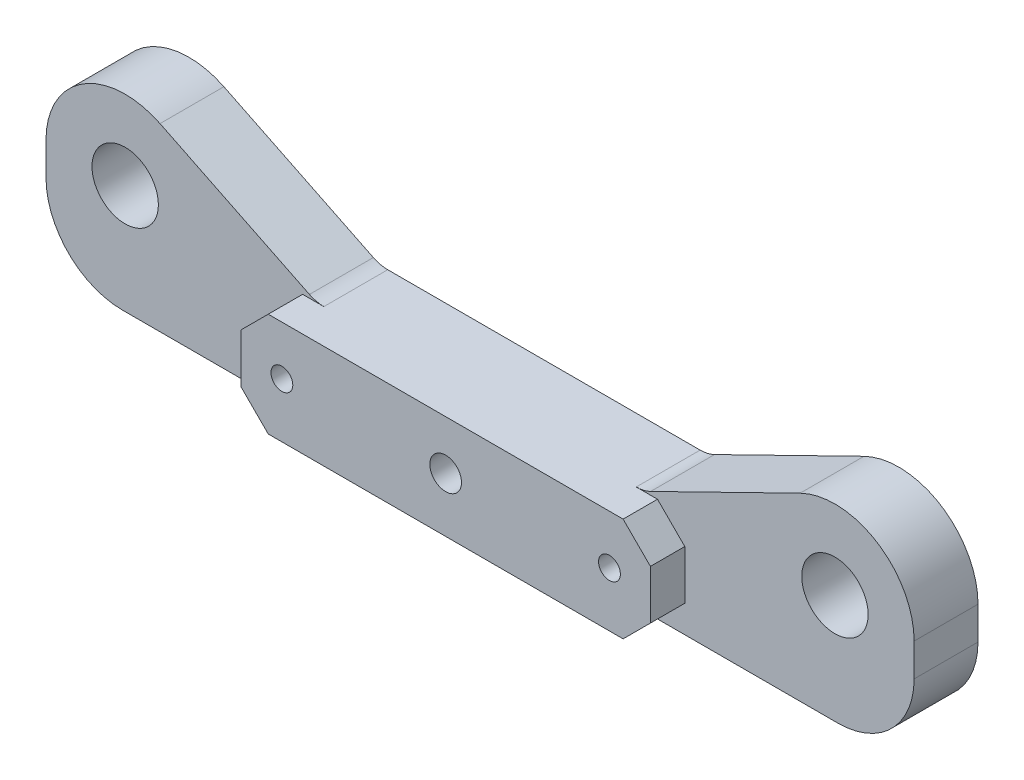
ISO-10303-21;
HEADER;
FILE_DESCRIPTION(('STEP AP214'),'2;1');
FILE_NAME('part.step','',(''),(''),'','','');
FILE_SCHEMA(('AUTOMOTIVE_DESIGN { 1 0 10303 214 1 1 1 1 }'));
ENDSEC;
DATA;
#1=APPLICATION_CONTEXT('core data for automotive mechanical design processes');
#2=APPLICATION_PROTOCOL_DEFINITION('international standard','automotive_design',2000,#1);
#3=PRODUCT_CONTEXT('',#1,'mechanical');
#4=PRODUCT('Part','Part','',(#3));
#5=PRODUCT_RELATED_PRODUCT_CATEGORY('part','',(#4));
#6=PRODUCT_DEFINITION_FORMATION('','',#4);
#7=PRODUCT_DEFINITION_CONTEXT('part definition',#1,'design');
#8=PRODUCT_DEFINITION('design','',#6,#7);
#9=PRODUCT_DEFINITION_SHAPE('','',#8);
#10=(LENGTH_UNIT() NAMED_UNIT(*) SI_UNIT(.MILLI.,.METRE.));
#11=(NAMED_UNIT(*) PLANE_ANGLE_UNIT() SI_UNIT($,.RADIAN.));
#12=(NAMED_UNIT(*) SI_UNIT($,.STERADIAN.) SOLID_ANGLE_UNIT());
#13=UNCERTAINTY_MEASURE_WITH_UNIT(LENGTH_MEASURE(1.E-05),#10,'distance_accuracy_value','');
#14=(GEOMETRIC_REPRESENTATION_CONTEXT(3) GLOBAL_UNCERTAINTY_ASSIGNED_CONTEXT((#13)) GLOBAL_UNIT_ASSIGNED_CONTEXT((#10,
#11,#12)) REPRESENTATION_CONTEXT('',''));
#15=CARTESIAN_POINT('',(0.,0.,0.));
#16=DIRECTION('',(0.,0.,1.));
#17=DIRECTION('',(1.,0.,0.));
#18=AXIS2_PLACEMENT_3D('',#15,#16,#17);
#19=CARTESIAN_POINT('',(-15.,0.,-9.));
#20=DIRECTION('',(0.,0.,-1.));
#21=DIRECTION('',(1.,0.,0.));
#22=AXIS2_PLACEMENT_3D('',#19,#20,#21);
#23=CYLINDRICAL_SURFACE('',#22,0.999999999999994);
#24=CARTESIAN_POINT('',(-15.,0.,0.));
#25=DIRECTION('',(0.,0.,-1.));
#26=DIRECTION('',(-1.,0.,0.));
#27=AXIS2_PLACEMENT_3D('',#24,#25,#26);
#28=CIRCLE('',#27,0.999999999999994);
#29=CARTESIAN_POINT('',(-16.,0.,0.));
#30=VERTEX_POINT('',#29);
#31=EDGE_CURVE('E335',#30,#30,#28,.T.);
#32=ORIENTED_EDGE('',*,*,#31,.F.);
#33=EDGE_LOOP('',(#32));
#34=FACE_BOUND('',#33,.T.);
#35=CARTESIAN_POINT('',(-15.,0.,-7.));
#36=DIRECTION('',(0.,0.,1.));
#37=DIRECTION('',(1.,0.,0.));
#38=AXIS2_PLACEMENT_3D('',#35,#36,#37);
#39=CIRCLE('',#38,0.999999999999994);
#40=CARTESIAN_POINT('',(-14.,0.,-7.));
#41=VERTEX_POINT('',#40);
#42=EDGE_CURVE('E269',#41,#41,#39,.F.);
#43=ORIENTED_EDGE('',*,*,#42,.T.);
#44=EDGE_LOOP('',(#43));
#45=FACE_BOUND('',#44,.T.);
#46=ADVANCED_FACE('F40',(#34,#45),#23,.F.);
#47=CARTESIAN_POINT('',(-32.5,5.,17.3560966544099));
#48=DIRECTION('',(0.,0.,-1.));
#49=DIRECTION('',(1.,0.,0.));
#50=AXIS2_PLACEMENT_3D('',#47,#48,#49);
#51=CYLINDRICAL_SURFACE('',#50,7.25000000000001);
#52=DIRECTION('',(0.,0.,1.));
#53=VECTOR('',#52,1.);
#54=CARTESIAN_POINT('',(-39.75,4.99999999999995,-19.0498756211209));
#55=LINE('',#54,#53);
#56=CARTESIAN_POINT('',(-39.75,4.99999999999995,-9.));
#57=VERTEX_POINT('',#56);
#58=CARTESIAN_POINT('',(-39.75,4.99999999999995,-3.15000000000003));
#59=VERTEX_POINT('',#58);
#60=EDGE_CURVE('E180',#57,#59,#55,.T.);
#61=ORIENTED_EDGE('',*,*,#60,.T.);
#62=CARTESIAN_POINT('',(-32.5,5.,-3.15));
#63=DIRECTION('',(0.,0.,1.));
#64=DIRECTION('',(1.,0.,0.));
#65=AXIS2_PLACEMENT_3D('',#62,#63,#64);
#66=CIRCLE('',#65,7.25000000000001);
#67=CARTESIAN_POINT('',(-29.3104090214584,11.5106842489562,-3.15));
#68=VERTEX_POINT('',#67);
#69=EDGE_CURVE('E188',#59,#68,#66,.F.);
#70=ORIENTED_EDGE('',*,*,#69,.T.);
#71=DIRECTION('',(0.,0.,1.));
#72=VECTOR('',#71,1.);
#73=CARTESIAN_POINT('',(-29.3104090214584,11.5106842489562,-24.9354165304833));
#74=LINE('',#73,#72);
#75=CARTESIAN_POINT('',(-29.3104090214584,11.5106842489562,-9.));
#76=VERTEX_POINT('',#75);
#77=EDGE_CURVE('E248',#76,#68,#74,.T.);
#78=ORIENTED_EDGE('',*,*,#77,.F.);
#79=CARTESIAN_POINT('',(-32.5,5.,-9.));
#80=DIRECTION('',(0.,0.,1.));
#81=DIRECTION('',(1.,0.,0.));
#82=AXIS2_PLACEMENT_3D('',#79,#80,#81);
#83=CIRCLE('',#82,7.25000000000001);
#84=EDGE_CURVE('E199',#76,#57,#83,.T.);
#85=ORIENTED_EDGE('',*,*,#84,.T.);
#86=EDGE_LOOP('',(#61,#70,#78,#85));
#87=FACE_BOUND('',#86,.T.);
#88=ADVANCED_FACE('F202',(#87),#51,.T.);
#89=CARTESIAN_POINT('',(38.75,-3.50000000000001,-3.14999999999999));
#90=DIRECTION('',(0.,0.,-1.));
#91=DIRECTION('',(1.,0.,0.));
#92=AXIS2_PLACEMENT_3D('',#89,#90,#91);
#93=PLANE('',#92);
#94=DIRECTION('',(0.,-1.,0.));
#95=VECTOR('',#94,1.);
#96=CARTESIAN_POINT('',(39.75,4.99999999999995,-3.14999999999999));
#97=LINE('',#96,#95);
#98=CARTESIAN_POINT('',(39.75,4.99999999999999,-3.15));
#99=VERTEX_POINT('',#98);
#100=CARTESIAN_POINT('',(39.75,2.,-3.14999999999999));
#101=VERTEX_POINT('',#100);
#102=EDGE_CURVE('E204',#99,#101,#97,.T.);
#103=ORIENTED_EDGE('',*,*,#102,.F.);
#104=CARTESIAN_POINT('',(32.5,5.,-3.15));
#105=DIRECTION('',(0.,0.,1.));
#106=DIRECTION('',(1.,0.,0.));
#107=AXIS2_PLACEMENT_3D('',#104,#105,#106);
#108=CIRCLE('',#107,7.25000000000001);
#109=CARTESIAN_POINT('',(29.3104090214584,11.5106842489562,-3.15000000000002));
#110=VERTEX_POINT('',#109);
#111=EDGE_CURVE('E291',#110,#99,#108,.F.);
#112=ORIENTED_EDGE('',*,*,#111,.F.);
#113=DIRECTION('',(0.898025413649127,0.439943583247118,0.));
#114=VECTOR('',#113,1.);
#115=CARTESIAN_POINT('',(29.3104090214584,11.5106842489562,-3.15000000000002));
#116=LINE('',#115,#114);
#117=CARTESIAN_POINT('',(15.624460318845,4.80592375905262,-3.15000000000001));
#118=VERTEX_POINT('',#117);
#119=EDGE_CURVE('E283',#118,#110,#116,.T.);
#120=ORIENTED_EDGE('',*,*,#119,.F.);
#121=CARTESIAN_POINT('',(14.3046295691037,7.5,-3.15));
#122=DIRECTION('',(0.,0.,1.));
#123=DIRECTION('',(1.,0.,0.));
#124=AXIS2_PLACEMENT_3D('',#121,#122,#123);
#125=CIRCLE('',#124,3.);
#126=CARTESIAN_POINT('',(14.3046295691037,4.5,-3.15000000000001));
#127=VERTEX_POINT('',#126);
#128=EDGE_CURVE('E397',#127,#118,#125,.T.);
#129=ORIENTED_EDGE('',*,*,#128,.F.);
#130=DIRECTION('',(-1.,0.,0.));
#131=VECTOR('',#130,1.);
#132=CARTESIAN_POINT('',(15.,4.5,-3.15000000000001));
#133=LINE('',#132,#131);
#134=CARTESIAN_POINT('',(16.25,4.5,-3.15000000000001));
#135=VERTEX_POINT('',#134);
#136=EDGE_CURVE('E278',#135,#127,#133,.T.);
#137=ORIENTED_EDGE('',*,*,#136,.F.);
#138=DIRECTION('',(-0.707106781186546,0.707106781186549,0.));
#139=VECTOR('',#138,1.);
#140=CARTESIAN_POINT('',(31.5,-10.75,-3.14999999999999));
#141=LINE('',#140,#139);
#142=CARTESIAN_POINT('',(18.75,2.,-3.15));
#143=VERTEX_POINT('',#142);
#144=EDGE_CURVE('E263',#143,#135,#141,.T.);
#145=ORIENTED_EDGE('',*,*,#144,.F.);
#146=DIRECTION('',(0.,1.,0.));
#147=VECTOR('',#146,1.);
#148=CARTESIAN_POINT('',(18.75,-3.50000000000001,-3.15));
#149=LINE('',#148,#147);
#150=CARTESIAN_POINT('',(18.75,-2.49999999999998,-3.15));
#151=VERTEX_POINT('',#150);
#152=EDGE_CURVE('E338',#151,#143,#149,.T.);
#153=ORIENTED_EDGE('',*,*,#152,.F.);
#154=DIRECTION('',(0.707106781186546,0.707106781186549,0.));
#155=VECTOR('',#154,1.);
#156=CARTESIAN_POINT('',(28.2499999999999,7.,-3.14999999999999));
#157=LINE('',#156,#155);
#158=CARTESIAN_POINT('',(16.25,-5.,-3.15));
#159=VERTEX_POINT('',#158);
#160=EDGE_CURVE('E264',#159,#151,#157,.T.);
#161=ORIENTED_EDGE('',*,*,#160,.F.);
#162=DIRECTION('',(1.,0.,0.));
#163=VECTOR('',#162,1.);
#164=CARTESIAN_POINT('',(18.75,-5.,-3.15));
#165=LINE('',#164,#163);
#166=CARTESIAN_POINT('',(32.75,-5.,-3.14999999999999));
#167=VERTEX_POINT('',#166);
#168=EDGE_CURVE('E218',#159,#167,#165,.T.);
#169=ORIENTED_EDGE('',*,*,#168,.T.);
#170=CARTESIAN_POINT('',(32.75,2.,-3.14999999999999));
#171=DIRECTION('',(0.,0.,1.));
#172=DIRECTION('',(1.,0.,0.));
#173=AXIS2_PLACEMENT_3D('',#170,#171,#172);
#174=CIRCLE('',#173,7.);
#175=EDGE_CURVE('E12',#101,#167,#174,.F.);
#176=ORIENTED_EDGE('',*,*,#175,.F.);
#177=EDGE_LOOP('',(#103,#112,#120,#129,#137,#145,#153,#161,#169,#176));
#178=FACE_BOUND('',#177,.T.);
#179=CARTESIAN_POINT('',(32.5,5.,-3.14999999999999));
#180=DIRECTION('',(0.,0.,1.));
#181=DIRECTION('',(1.,0.,0.));
#182=AXIS2_PLACEMENT_3D('',#179,#180,#181);
#183=CIRCLE('',#182,3.04);
#184=CARTESIAN_POINT('',(35.54,5.,-3.14999999999999));
#185=VERTEX_POINT('',#184);
#186=EDGE_CURVE('E334',#185,#185,#183,.F.);
#187=ORIENTED_EDGE('',*,*,#186,.T.);
#188=EDGE_LOOP('',(#187));
#189=FACE_BOUND('',#188,.T.);
#190=ADVANCED_FACE('F447',(#178,#189),#93,.F.);
#191=CARTESIAN_POINT('',(-38.75,3.49999999999999,-9.));
#192=DIRECTION('',(0.,0.,-1.));
#193=DIRECTION('',(1.,0.,0.));
#194=AXIS2_PLACEMENT_3D('',#191,#192,#193);
#195=PLANE('',#194);
#196=DIRECTION('',(0.,1.,0.));
#197=VECTOR('',#196,1.);
#198=CARTESIAN_POINT('',(-39.75,4.99999999999995,-9.));
#199=LINE('',#198,#197);
#200=CARTESIAN_POINT('',(-39.75,2.,-9.));
#201=VERTEX_POINT('',#200);
#202=EDGE_CURVE('E185',#201,#57,#199,.T.);
#203=ORIENTED_EDGE('',*,*,#202,.T.);
#204=ORIENTED_EDGE('',*,*,#84,.F.);
#205=DIRECTION('',(0.898025413649127,-0.439943583247118,0.));
#206=VECTOR('',#205,1.);
#207=CARTESIAN_POINT('',(-29.3104090214584,11.5106842489562,-9.));
#208=LINE('',#207,#206);
#209=CARTESIAN_POINT('',(-15.624460318845,4.80592375905261,-9.));
#210=VERTEX_POINT('',#209);
#211=EDGE_CURVE('E254',#76,#210,#208,.T.);
#212=ORIENTED_EDGE('',*,*,#211,.T.);
#213=CARTESIAN_POINT('',(-14.3046295691037,7.5,-9.));
#214=DIRECTION('',(0.,0.,1.));
#215=DIRECTION('',(1.,0.,0.));
#216=AXIS2_PLACEMENT_3D('',#213,#214,#215);
#217=CIRCLE('',#216,3.);
#218=CARTESIAN_POINT('',(-14.3046295691037,4.5,-9.));
#219=VERTEX_POINT('',#218);
#220=EDGE_CURVE('E383',#219,#210,#217,.F.);
#221=ORIENTED_EDGE('',*,*,#220,.F.);
#222=DIRECTION('',(1.,0.,0.));
#223=VECTOR('',#222,1.);
#224=CARTESIAN_POINT('',(-26.25,4.5,-9.));
#225=LINE('',#224,#223);
#226=CARTESIAN_POINT('',(14.3046295691037,4.5,-9.));
#227=VERTEX_POINT('',#226);
#228=EDGE_CURVE('E300',#219,#227,#225,.T.);
#229=ORIENTED_EDGE('',*,*,#228,.T.);
#230=CARTESIAN_POINT('',(14.3046295691037,7.5,-9.));
#231=DIRECTION('',(0.,0.,1.));
#232=DIRECTION('',(1.,0.,0.));
#233=AXIS2_PLACEMENT_3D('',#230,#231,#232);
#234=CIRCLE('',#233,3.);
#235=CARTESIAN_POINT('',(15.624460318845,4.80592375905262,-9.));
#236=VERTEX_POINT('',#235);
#237=EDGE_CURVE('E380',#236,#227,#234,.F.);
#238=ORIENTED_EDGE('',*,*,#237,.F.);
#239=DIRECTION('',(0.898025413649127,0.439943583247118,0.));
#240=VECTOR('',#239,1.);
#241=CARTESIAN_POINT('',(29.3104090214584,11.5106842489562,-9.));
#242=LINE('',#241,#240);
#243=CARTESIAN_POINT('',(29.3104090214584,11.5106842489562,-9.));
#244=VERTEX_POINT('',#243);
#245=EDGE_CURVE('E285',#236,#244,#242,.T.);
#246=ORIENTED_EDGE('',*,*,#245,.T.);
#247=CARTESIAN_POINT('',(32.5,5.,-9.));
#248=DIRECTION('',(0.,0.,1.));
#249=DIRECTION('',(-1.,0.,0.));
#250=AXIS2_PLACEMENT_3D('',#247,#248,#249);
#251=CIRCLE('',#250,7.25000000000001);
#252=CARTESIAN_POINT('',(39.75,4.99999999999995,-9.));
#253=VERTEX_POINT('',#252);
#254=EDGE_CURVE('E290',#253,#244,#251,.T.);
#255=ORIENTED_EDGE('',*,*,#254,.F.);
#256=DIRECTION('',(0.,-1.,0.));
#257=VECTOR('',#256,1.);
#258=CARTESIAN_POINT('',(39.75,4.99999999999995,-9.));
#259=LINE('',#258,#257);
#260=CARTESIAN_POINT('',(39.75,2.,-9.));
#261=VERTEX_POINT('',#260);
#262=EDGE_CURVE('E206',#253,#261,#259,.T.);
#263=ORIENTED_EDGE('',*,*,#262,.T.);
#264=CARTESIAN_POINT('',(32.75,2.,-9.));
#265=DIRECTION('',(0.,0.,1.));
#266=DIRECTION('',(1.,0.,0.));
#267=AXIS2_PLACEMENT_3D('',#264,#265,#266);
#268=CIRCLE('',#267,7.);
#269=CARTESIAN_POINT('',(32.75,-5.,-9.));
#270=VERTEX_POINT('',#269);
#271=EDGE_CURVE('E467',#270,#261,#268,.T.);
#272=ORIENTED_EDGE('',*,*,#271,.F.);
#273=DIRECTION('',(-1.,0.,0.));
#274=VECTOR('',#273,1.);
#275=CARTESIAN_POINT('',(38.75,-5.,-9.));
#276=LINE('',#275,#274);
#277=CARTESIAN_POINT('',(-32.75,-5.,-9.));
#278=VERTEX_POINT('',#277);
#279=EDGE_CURVE('E223',#270,#278,#276,.T.);
#280=ORIENTED_EDGE('',*,*,#279,.T.);
#281=CARTESIAN_POINT('',(-32.75,2.,-9.));
#282=DIRECTION('',(0.,0.,1.));
#283=DIRECTION('',(1.,0.,0.));
#284=AXIS2_PLACEMENT_3D('',#281,#282,#283);
#285=CIRCLE('',#284,7.);
#286=EDGE_CURVE('E465',#201,#278,#285,.T.);
#287=ORIENTED_EDGE('',*,*,#286,.F.);
#288=EDGE_LOOP('',(#203,#204,#212,#221,#229,#238,#246,#255,#263,#272,#280,#287));
#289=FACE_BOUND('',#288,.T.);
#290=CARTESIAN_POINT('',(0.,0.,-9.));
#291=DIRECTION('',(0.,0.,1.));
#292=DIRECTION('',(1.,0.,0.));
#293=AXIS2_PLACEMENT_3D('',#290,#291,#292);
#294=CIRCLE('',#293,2.75);
#295=CARTESIAN_POINT('',(2.75,0.,-9.));
#296=VERTEX_POINT('',#295);
#297=EDGE_CURVE('E369',#296,#296,#294,.T.);
#298=ORIENTED_EDGE('',*,*,#297,.T.);
#299=EDGE_LOOP('',(#298));
#300=FACE_BOUND('',#299,.T.);
#301=CARTESIAN_POINT('',(-32.5,5.,-9.));
#302=DIRECTION('',(0.,0.,1.));
#303=DIRECTION('',(1.,0.,0.));
#304=AXIS2_PLACEMENT_3D('',#301,#302,#303);
#305=CIRCLE('',#304,3.04);
#306=CARTESIAN_POINT('',(-29.46,5.,-9.));
#307=VERTEX_POINT('',#306);
#308=EDGE_CURVE('E232',#307,#307,#305,.T.);
#309=ORIENTED_EDGE('',*,*,#308,.T.);
#310=EDGE_LOOP('',(#309));
#311=FACE_BOUND('',#310,.T.);
#312=CARTESIAN_POINT('',(32.5,5.,-9.));
#313=DIRECTION('',(0.,0.,1.));
#314=DIRECTION('',(1.,0.,0.));
#315=AXIS2_PLACEMENT_3D('',#312,#313,#314);
#316=CIRCLE('',#315,3.04);
#317=CARTESIAN_POINT('',(35.54,5.,-9.));
#318=VERTEX_POINT('',#317);
#319=EDGE_CURVE('E561',#318,#318,#316,.F.);
#320=ORIENTED_EDGE('',*,*,#319,.F.);
#321=EDGE_LOOP('',(#320));
#322=FACE_BOUND('',#321,.T.);
#323=ADVANCED_FACE('F378',(#289,#300,#311,#322),#195,.T.);
#324=CARTESIAN_POINT('',(-32.5,5.,-22.));
#325=DIRECTION('',(0.,0.,1.));
#326=DIRECTION('',(-1.,0.,0.));
#327=AXIS2_PLACEMENT_3D('',#324,#325,#326);
#328=CYLINDRICAL_SURFACE('',#327,3.04);
#329=CARTESIAN_POINT('',(-32.5,5.,-3.15));
#330=DIRECTION('',(0.,0.,1.));
#331=DIRECTION('',(1.,0.,0.));
#332=AXIS2_PLACEMENT_3D('',#329,#330,#331);
#333=CIRCLE('',#332,3.04);
#334=CARTESIAN_POINT('',(-29.46,5.,-3.15));
#335=VERTEX_POINT('',#334);
#336=EDGE_CURVE('E342',#335,#335,#333,.F.);
#337=ORIENTED_EDGE('',*,*,#336,.F.);
#338=EDGE_LOOP('',(#337));
#339=FACE_BOUND('',#338,.T.);
#340=ORIENTED_EDGE('',*,*,#308,.F.);
#341=EDGE_LOOP('',(#340));
#342=FACE_BOUND('',#341,.T.);
#343=ADVANCED_FACE('F509',(#339,#342),#328,.F.);
#344=CARTESIAN_POINT('',(32.5,5.,-22.));
#345=DIRECTION('',(0.,0.,1.));
#346=DIRECTION('',(-1.,0.,0.));
#347=AXIS2_PLACEMENT_3D('',#344,#345,#346);
#348=CYLINDRICAL_SURFACE('',#347,3.04);
#349=ORIENTED_EDGE('',*,*,#186,.F.);
#350=EDGE_LOOP('',(#349));
#351=FACE_BOUND('',#350,.T.);
#352=ORIENTED_EDGE('',*,*,#319,.T.);
#353=EDGE_LOOP('',(#352));
#354=FACE_BOUND('',#353,.T.);
#355=ADVANCED_FACE('F506',(#351,#354),#348,.F.);
#356=CARTESIAN_POINT('',(-38.75,-3.50000000000001,-3.15));
#357=DIRECTION('',(0.,0.,-1.));
#358=DIRECTION('',(1.,0.,0.));
#359=AXIS2_PLACEMENT_3D('',#356,#357,#358);
#360=PLANE('',#359);
#361=DIRECTION('',(1.,0.,0.));
#362=VECTOR('',#361,1.);
#363=CARTESIAN_POINT('',(-38.75,-5.00000000000001,-3.15));
#364=LINE('',#363,#362);
#365=CARTESIAN_POINT('',(-32.75,-5.,-3.15));
#366=VERTEX_POINT('',#365);
#367=CARTESIAN_POINT('',(-16.25,-5.,-3.15));
#368=VERTEX_POINT('',#367);
#369=EDGE_CURVE('E229',#366,#368,#364,.T.);
#370=ORIENTED_EDGE('',*,*,#369,.T.);
#371=DIRECTION('',(0.707106781186546,-0.707106781186549,0.));
#372=VECTOR('',#371,1.);
#373=CARTESIAN_POINT('',(-28.25,6.99999999999998,-3.15));
#374=LINE('',#373,#372);
#375=CARTESIAN_POINT('',(-18.75,-2.5,-3.15));
#376=VERTEX_POINT('',#375);
#377=EDGE_CURVE('E414',#376,#368,#374,.T.);
#378=ORIENTED_EDGE('',*,*,#377,.F.);
#379=DIRECTION('',(0.,1.,0.));
#380=VECTOR('',#379,1.);
#381=CARTESIAN_POINT('',(-18.75,-3.50000000000001,-3.15));
#382=LINE('',#381,#380);
#383=CARTESIAN_POINT('',(-18.75,1.99999999999998,-3.15));
#384=VERTEX_POINT('',#383);
#385=EDGE_CURVE('E341',#376,#384,#382,.T.);
#386=ORIENTED_EDGE('',*,*,#385,.T.);
#387=DIRECTION('',(-0.707106781186546,-0.707106781186549,0.));
#388=VECTOR('',#387,1.);
#389=CARTESIAN_POINT('',(-31.5,-10.75,-3.15));
#390=LINE('',#389,#388);
#391=CARTESIAN_POINT('',(-16.25,4.5,-3.15));
#392=VERTEX_POINT('',#391);
#393=EDGE_CURVE('E259',#392,#384,#390,.T.);
#394=ORIENTED_EDGE('',*,*,#393,.F.);
#395=DIRECTION('',(-1.,0.,0.));
#396=VECTOR('',#395,1.);
#397=CARTESIAN_POINT('',(-15.,4.5,-3.15));
#398=LINE('',#397,#396);
#399=CARTESIAN_POINT('',(-14.3046295691037,4.5,-3.15));
#400=VERTEX_POINT('',#399);
#401=EDGE_CURVE('E249',#400,#392,#398,.T.);
#402=ORIENTED_EDGE('',*,*,#401,.F.);
#403=CARTESIAN_POINT('',(-14.3046295691037,7.5,-3.15));
#404=DIRECTION('',(0.,0.,1.));
#405=DIRECTION('',(1.,0.,0.));
#406=AXIS2_PLACEMENT_3D('',#403,#404,#405);
#407=CIRCLE('',#406,3.);
#408=CARTESIAN_POINT('',(-15.624460318845,4.80592375905262,-3.15));
#409=VERTEX_POINT('',#408);
#410=EDGE_CURVE('E396',#409,#400,#407,.T.);
#411=ORIENTED_EDGE('',*,*,#410,.F.);
#412=DIRECTION('',(0.898025413649127,-0.439943583247118,0.));
#413=VECTOR('',#412,1.);
#414=CARTESIAN_POINT('',(-29.3104090214584,11.5106842489562,-3.14999999999999));
#415=LINE('',#414,#413);
#416=EDGE_CURVE('E194',#68,#409,#415,.T.);
#417=ORIENTED_EDGE('',*,*,#416,.F.);
#418=ORIENTED_EDGE('',*,*,#69,.F.);
#419=DIRECTION('',(0.,1.,0.));
#420=VECTOR('',#419,1.);
#421=CARTESIAN_POINT('',(-39.75,4.99999999999995,-3.15000000000003));
#422=LINE('',#421,#420);
#423=CARTESIAN_POINT('',(-39.75,2.,-3.15000000000003));
#424=VERTEX_POINT('',#423);
#425=EDGE_CURVE('E175',#424,#59,#422,.T.);
#426=ORIENTED_EDGE('',*,*,#425,.F.);
#427=CARTESIAN_POINT('',(-32.75,2.,-3.15));
#428=DIRECTION('',(0.,0.,1.));
#429=DIRECTION('',(1.,0.,0.));
#430=AXIS2_PLACEMENT_3D('',#427,#428,#429);
#431=CIRCLE('',#430,7.);
#432=EDGE_CURVE('E457',#366,#424,#431,.F.);
#433=ORIENTED_EDGE('',*,*,#432,.F.);
#434=EDGE_LOOP('',(#370,#378,#386,#394,#402,#411,#417,#418,#426,#433));
#435=FACE_BOUND('',#434,.T.);
#436=ORIENTED_EDGE('',*,*,#336,.T.);
#437=EDGE_LOOP('',(#436));
#438=FACE_BOUND('',#437,.T.);
#439=ADVANCED_FACE('F190',(#435,#438),#360,.F.);
#440=CARTESIAN_POINT('',(-18.75,-3.50000000000001,3.15));
#441=DIRECTION('',(1.,0.,0.));
#442=DIRECTION('',(0.,1.,0.));
#443=AXIS2_PLACEMENT_3D('',#440,#441,#442);
#444=PLANE('',#443);
#445=DIRECTION('',(0.,-1.,0.));
#446=VECTOR('',#445,1.);
#447=CARTESIAN_POINT('',(-18.75,-3.50000000000001,0.));
#448=LINE('',#447,#446);
#449=CARTESIAN_POINT('',(-18.75,1.99999999999998,0.));
#450=VERTEX_POINT('',#449);
#451=CARTESIAN_POINT('',(-18.75,-2.5,0.));
#452=VERTEX_POINT('',#451);
#453=EDGE_CURVE('E330',#450,#452,#448,.T.);
#454=ORIENTED_EDGE('',*,*,#453,.F.);
#455=DIRECTION('',(0.,0.,1.));
#456=VECTOR('',#455,1.);
#457=CARTESIAN_POINT('',(-18.75,1.99999999999998,0.));
#458=LINE('',#457,#456);
#459=EDGE_CURVE('E324',#384,#450,#458,.T.);
#460=ORIENTED_EDGE('',*,*,#459,.F.);
#461=ORIENTED_EDGE('',*,*,#385,.F.);
#462=DIRECTION('',(0.,0.,-1.));
#463=VECTOR('',#462,1.);
#464=CARTESIAN_POINT('',(-18.75,-2.5,-3.15));
#465=LINE('',#464,#463);
#466=EDGE_CURVE('E437',#452,#376,#465,.T.);
#467=ORIENTED_EDGE('',*,*,#466,.F.);
#468=EDGE_LOOP('',(#454,#460,#461,#467));
#469=FACE_BOUND('',#468,.T.);
#470=ADVANCED_FACE('F456',(#469),#444,.F.);
#471=CARTESIAN_POINT('',(18.75,-3.50000000000001,3.15));
#472=DIRECTION('',(-1.,0.,0.));
#473=DIRECTION('',(0.,-1.,0.));
#474=AXIS2_PLACEMENT_3D('',#471,#472,#473);
#475=PLANE('',#474);
#476=ORIENTED_EDGE('',*,*,#152,.T.);
#477=DIRECTION('',(0.,0.,-1.));
#478=VECTOR('',#477,1.);
#479=CARTESIAN_POINT('',(18.75,2.,-3.15));
#480=LINE('',#479,#478);
#481=CARTESIAN_POINT('',(18.75,2.,0.));
#482=VERTEX_POINT('',#481);
#483=EDGE_CURVE('E432',#482,#143,#480,.T.);
#484=ORIENTED_EDGE('',*,*,#483,.F.);
#485=DIRECTION('',(0.,-1.,0.));
#486=VECTOR('',#485,1.);
#487=CARTESIAN_POINT('',(18.75,-3.50000000000001,0.));
#488=LINE('',#487,#486);
#489=CARTESIAN_POINT('',(18.75,-2.49999999999998,0.));
#490=VERTEX_POINT('',#489);
#491=EDGE_CURVE('E346',#482,#490,#488,.T.);
#492=ORIENTED_EDGE('',*,*,#491,.T.);
#493=DIRECTION('',(0.,0.,1.));
#494=VECTOR('',#493,1.);
#495=CARTESIAN_POINT('',(18.75,-2.49999999999998,0.));
#496=LINE('',#495,#494);
#497=EDGE_CURVE('E427',#151,#490,#496,.T.);
#498=ORIENTED_EDGE('',*,*,#497,.F.);
#499=EDGE_LOOP('',(#476,#484,#492,#498));
#500=FACE_BOUND('',#499,.T.);
#501=ADVANCED_FACE('F433',(#500),#475,.F.);
#502=CARTESIAN_POINT('',(15.,11.5,0.));
#503=DIRECTION('',(0.,0.,1.));
#504=DIRECTION('',(-1.,0.,0.));
#505=AXIS2_PLACEMENT_3D('',#502,#503,#504);
#506=PLANE('',#505);
#507=CARTESIAN_POINT('',(0.,0.,0.));
#508=DIRECTION('',(0.,0.,1.));
#509=DIRECTION('',(1.,0.,0.));
#510=AXIS2_PLACEMENT_3D('',#507,#508,#509);
#511=CIRCLE('',#510,1.45);
#512=CARTESIAN_POINT('',(1.45,0.,0.));
#513=VERTEX_POINT('',#512);
#514=EDGE_CURVE('E360',#513,#513,#511,.T.);
#515=ORIENTED_EDGE('',*,*,#514,.F.);
#516=EDGE_LOOP('',(#515));
#517=FACE_BOUND('',#516,.T.);
#518=CARTESIAN_POINT('',(15.,0.,0.));
#519=DIRECTION('',(0.,0.,-1.));
#520=DIRECTION('',(-1.,0.,0.));
#521=AXIS2_PLACEMENT_3D('',#518,#519,#520);
#522=CIRCLE('',#521,0.999999999999997);
#523=CARTESIAN_POINT('',(14.,0.,0.));
#524=VERTEX_POINT('',#523);
#525=EDGE_CURVE('E336',#524,#524,#522,.T.);
#526=ORIENTED_EDGE('',*,*,#525,.T.);
#527=EDGE_LOOP('',(#526));
#528=FACE_BOUND('',#527,.T.);
#529=ORIENTED_EDGE('',*,*,#31,.T.);
#530=EDGE_LOOP('',(#529));
#531=FACE_BOUND('',#530,.T.);
#532=DIRECTION('',(1.,0.,0.));
#533=VECTOR('',#532,1.);
#534=CARTESIAN_POINT('',(-18.75,-5.,0.));
#535=LINE('',#534,#533);
#536=CARTESIAN_POINT('',(-16.25,-5.,0.));
#537=VERTEX_POINT('',#536);
#538=CARTESIAN_POINT('',(16.25,-5.,0.));
#539=VERTEX_POINT('',#538);
#540=EDGE_CURVE('E224',#537,#539,#535,.T.);
#541=ORIENTED_EDGE('',*,*,#540,.T.);
#542=DIRECTION('',(-0.707106781186546,-0.707106781186549,0.));
#543=VECTOR('',#542,1.);
#544=CARTESIAN_POINT('',(23.875,2.62500000000004,0.));
#545=LINE('',#544,#543);
#546=EDGE_CURVE('E317',#490,#539,#545,.T.);
#547=ORIENTED_EDGE('',*,*,#546,.F.);
#548=ORIENTED_EDGE('',*,*,#491,.F.);
#549=DIRECTION('',(0.707106781186546,-0.707106781186549,0.));
#550=VECTOR('',#549,1.);
#551=CARTESIAN_POINT('',(12.125,8.62500000000002,0.));
#552=LINE('',#551,#550);
#553=CARTESIAN_POINT('',(16.25,4.5,0.));
#554=VERTEX_POINT('',#553);
#555=EDGE_CURVE('E309',#554,#482,#552,.T.);
#556=ORIENTED_EDGE('',*,*,#555,.F.);
#557=DIRECTION('',(-1.,0.,0.));
#558=VECTOR('',#557,1.);
#559=CARTESIAN_POINT('',(18.75,4.5,0.));
#560=LINE('',#559,#558);
#561=CARTESIAN_POINT('',(-16.25,4.5,0.));
#562=VERTEX_POINT('',#561);
#563=EDGE_CURVE('E198',#554,#562,#560,.T.);
#564=ORIENTED_EDGE('',*,*,#563,.T.);
#565=DIRECTION('',(0.707106781186546,0.707106781186549,0.));
#566=VECTOR('',#565,1.);
#567=CARTESIAN_POINT('',(2.87499999999991,23.625,0.));
#568=LINE('',#567,#566);
#569=EDGE_CURVE('E312',#450,#562,#568,.T.);
#570=ORIENTED_EDGE('',*,*,#569,.F.);
#571=ORIENTED_EDGE('',*,*,#453,.T.);
#572=DIRECTION('',(-0.707106781186546,0.707106781186549,0.));
#573=VECTOR('',#572,1.);
#574=CARTESIAN_POINT('',(-8.87500000000006,-12.375,0.));
#575=LINE('',#574,#573);
#576=EDGE_CURVE('E321',#537,#452,#575,.T.);
#577=ORIENTED_EDGE('',*,*,#576,.F.);
#578=EDGE_LOOP('',(#541,#547,#548,#556,#564,#570,#571,#577));
#579=FACE_BOUND('',#578,.T.);
#580=ADVANCED_FACE('F420',(#517,#528,#531,#579),#506,.T.);
#581=CARTESIAN_POINT('',(15.,0.,-9.));
#582=DIRECTION('',(0.,0.,-1.));
#583=DIRECTION('',(1.,0.,0.));
#584=AXIS2_PLACEMENT_3D('',#581,#582,#583);
#585=CYLINDRICAL_SURFACE('',#584,0.999999999999997);
#586=CARTESIAN_POINT('',(15.,0.,-7.));
#587=DIRECTION('',(0.,0.,1.));
#588=DIRECTION('',(-1.,0.,0.));
#589=AXIS2_PLACEMENT_3D('',#586,#587,#588);
#590=CIRCLE('',#589,0.999999999999996);
#591=CARTESIAN_POINT('',(14.,0.,-7.));
#592=VERTEX_POINT('',#591);
#593=EDGE_CURVE('E250',#592,#592,#590,.T.);
#594=ORIENTED_EDGE('',*,*,#593,.F.);
#595=EDGE_LOOP('',(#594));
#596=FACE_BOUND('',#595,.T.);
#597=ORIENTED_EDGE('',*,*,#525,.F.);
#598=EDGE_LOOP('',(#597));
#599=FACE_BOUND('',#598,.T.);
#600=ADVANCED_FACE('F501',(#596,#599),#585,.F.);
#601=CARTESIAN_POINT('',(-18.75,-5.,0.));
#602=DIRECTION('',(0.,-1.,0.));
#603=DIRECTION('',(1.,0.,0.));
#604=AXIS2_PLACEMENT_3D('',#601,#602,#603);
#605=PLANE('',#604);
#606=ORIENTED_EDGE('',*,*,#279,.F.);
#607=DIRECTION('',(0.,0.,1.));
#608=VECTOR('',#607,1.);
#609=CARTESIAN_POINT('',(32.75,-5.,0.));
#610=LINE('',#609,#608);
#611=EDGE_CURVE('E462',#167,#270,#610,.F.);
#612=ORIENTED_EDGE('',*,*,#611,.F.);
#613=ORIENTED_EDGE('',*,*,#168,.F.);
#614=DIRECTION('',(0.,0.,-1.));
#615=VECTOR('',#614,1.);
#616=CARTESIAN_POINT('',(16.25,-5.,-3.15));
#617=LINE('',#616,#615);
#618=EDGE_CURVE('E404',#539,#159,#617,.T.);
#619=ORIENTED_EDGE('',*,*,#618,.F.);
#620=ORIENTED_EDGE('',*,*,#540,.F.);
#621=DIRECTION('',(0.,0.,1.));
#622=VECTOR('',#621,1.);
#623=CARTESIAN_POINT('',(-16.25,-5.,0.));
#624=LINE('',#623,#622);
#625=EDGE_CURVE('E313',#368,#537,#624,.T.);
#626=ORIENTED_EDGE('',*,*,#625,.F.);
#627=ORIENTED_EDGE('',*,*,#369,.F.);
#628=DIRECTION('',(0.,0.,1.));
#629=VECTOR('',#628,1.);
#630=CARTESIAN_POINT('',(-32.75,-5.,0.));
#631=LINE('',#630,#629);
#632=EDGE_CURVE('E458',#278,#366,#631,.T.);
#633=ORIENTED_EDGE('',*,*,#632,.F.);
#634=EDGE_LOOP('',(#606,#612,#613,#619,#620,#626,#627,#633));
#635=FACE_BOUND('',#634,.T.);
#636=ADVANCED_FACE('F423',(#635),#605,.T.);
#637=CARTESIAN_POINT('',(0.,0.,-9.));
#638=DIRECTION('',(0.,0.,-1.));
#639=DIRECTION('',(1.,0.,0.));
#640=AXIS2_PLACEMENT_3D('',#637,#638,#639);
#641=CYLINDRICAL_SURFACE('',#640,1.45);
#642=ORIENTED_EDGE('',*,*,#514,.T.);
#643=EDGE_LOOP('',(#642));
#644=FACE_BOUND('',#643,.T.);
#645=CARTESIAN_POINT('',(0.,0.,-6.7));
#646=DIRECTION('',(0.,0.,1.));
#647=DIRECTION('',(1.,0.,0.));
#648=AXIS2_PLACEMENT_3D('',#645,#646,#647);
#649=CIRCLE('',#648,1.45);
#650=CARTESIAN_POINT('',(1.45,0.,-6.7));
#651=VERTEX_POINT('',#650);
#652=EDGE_CURVE('E364',#651,#651,#649,.T.);
#653=ORIENTED_EDGE('',*,*,#652,.F.);
#654=EDGE_LOOP('',(#653));
#655=FACE_BOUND('',#654,.T.);
#656=ADVANCED_FACE('F574',(#644,#655),#641,.F.);
#657=CARTESIAN_POINT('',(0.,0.,-8.));
#658=DIRECTION('',(0.,0.,-1.));
#659=DIRECTION('',(1.,0.,0.));
#660=AXIS2_PLACEMENT_3D('',#657,#658,#659);
#661=CONICAL_SURFACE('',#660,2.75,0.785398163397448);
#662=ORIENTED_EDGE('',*,*,#652,.T.);
#663=EDGE_LOOP('',(#662));
#664=FACE_BOUND('',#663,.T.);
#665=CARTESIAN_POINT('',(0.,0.,-8.));
#666=DIRECTION('',(0.,0.,1.));
#667=DIRECTION('',(1.,0.,0.));
#668=AXIS2_PLACEMENT_3D('',#665,#666,#667);
#669=CIRCLE('',#668,2.75);
#670=CARTESIAN_POINT('',(2.75,0.,-8.));
#671=VERTEX_POINT('',#670);
#672=EDGE_CURVE('E367',#671,#671,#669,.T.);
#673=ORIENTED_EDGE('',*,*,#672,.F.);
#674=EDGE_LOOP('',(#673));
#675=FACE_BOUND('',#674,.T.);
#676=ADVANCED_FACE('F578',(#664,#675),#661,.F.);
#677=CARTESIAN_POINT('',(0.,0.,-9.));
#678=DIRECTION('',(0.,0.,-1.));
#679=DIRECTION('',(1.,0.,0.));
#680=AXIS2_PLACEMENT_3D('',#677,#678,#679);
#681=CYLINDRICAL_SURFACE('',#680,2.75);
#682=ORIENTED_EDGE('',*,*,#672,.T.);
#683=EDGE_LOOP('',(#682));
#684=FACE_BOUND('',#683,.T.);
#685=ORIENTED_EDGE('',*,*,#297,.F.);
#686=EDGE_LOOP('',(#685));
#687=FACE_BOUND('',#686,.T.);
#688=ADVANCED_FACE('F584',(#684,#687),#681,.F.);
#689=CARTESIAN_POINT('',(18.75,4.5,0.));
#690=DIRECTION('',(0.,1.,0.));
#691=DIRECTION('',(-1.,0.,0.));
#692=AXIS2_PLACEMENT_3D('',#689,#690,#691);
#693=PLANE('',#692);
#694=ORIENTED_EDGE('',*,*,#563,.F.);
#695=DIRECTION('',(0.,0.,1.));
#696=VECTOR('',#695,1.);
#697=CARTESIAN_POINT('',(16.25,4.5,0.));
#698=LINE('',#697,#696);
#699=EDGE_CURVE('E439',#135,#554,#698,.T.);
#700=ORIENTED_EDGE('',*,*,#699,.F.);
#701=ORIENTED_EDGE('',*,*,#136,.T.);
#702=DIRECTION('',(0.,0.,1.));
#703=VECTOR('',#702,1.);
#704=CARTESIAN_POINT('',(14.3046295691037,4.5,-3.15000000000001));
#705=LINE('',#704,#703);
#706=EDGE_CURVE('E388',#227,#127,#705,.T.);
#707=ORIENTED_EDGE('',*,*,#706,.F.);
#708=ORIENTED_EDGE('',*,*,#228,.F.);
#709=DIRECTION('',(0.,0.,1.));
#710=VECTOR('',#709,1.);
#711=CARTESIAN_POINT('',(-14.3046295691037,4.5,-9.));
#712=LINE('',#711,#710);
#713=EDGE_CURVE('E353',#400,#219,#712,.F.);
#714=ORIENTED_EDGE('',*,*,#713,.F.);
#715=ORIENTED_EDGE('',*,*,#401,.T.);
#716=DIRECTION('',(0.,0.,-1.));
#717=VECTOR('',#716,1.);
#718=CARTESIAN_POINT('',(-16.25,4.5,-3.14999999999999));
#719=LINE('',#718,#717);
#720=EDGE_CURVE('E443',#562,#392,#719,.T.);
#721=ORIENTED_EDGE('',*,*,#720,.F.);
#722=EDGE_LOOP('',(#694,#700,#701,#707,#708,#714,#715,#721));
#723=FACE_BOUND('',#722,.T.);
#724=ADVANCED_FACE('F386',(#723),#693,.T.);
#725=CARTESIAN_POINT('',(32.5,5.,17.3560966544099));
#726=DIRECTION('',(0.,0.,-1.));
#727=DIRECTION('',(1.,0.,0.));
#728=AXIS2_PLACEMENT_3D('',#725,#726,#727);
#729=CYLINDRICAL_SURFACE('',#728,7.25000000000001);
#730=DIRECTION('',(0.,0.,1.));
#731=VECTOR('',#730,1.);
#732=CARTESIAN_POINT('',(39.75,4.99999999999995,-19.0498756211208));
#733=LINE('',#732,#731);
#734=EDGE_CURVE('E548',#253,#99,#733,.T.);
#735=ORIENTED_EDGE('',*,*,#734,.F.);
#736=ORIENTED_EDGE('',*,*,#254,.T.);
#737=DIRECTION('',(0.,0.,1.));
#738=VECTOR('',#737,1.);
#739=CARTESIAN_POINT('',(29.3104090214584,11.5106842489562,-24.9354165304833));
#740=LINE('',#739,#738);
#741=EDGE_CURVE('E288',#244,#110,#740,.T.);
#742=ORIENTED_EDGE('',*,*,#741,.T.);
#743=ORIENTED_EDGE('',*,*,#111,.T.);
#744=EDGE_LOOP('',(#735,#736,#742,#743));
#745=FACE_BOUND('',#744,.T.);
#746=ADVANCED_FACE('F550',(#745),#729,.T.);
#747=CARTESIAN_POINT('',(29.3104090214584,11.5106842489562,-24.9354165304833));
#748=DIRECTION('',(-0.439943583247118,0.898025413649127,0.));
#749=DIRECTION('',(-0.898025413649127,-0.439943583247118,0.));
#750=AXIS2_PLACEMENT_3D('',#747,#748,#749);
#751=PLANE('',#750);
#752=ORIENTED_EDGE('',*,*,#119,.T.);
#753=ORIENTED_EDGE('',*,*,#741,.F.);
#754=ORIENTED_EDGE('',*,*,#245,.F.);
#755=DIRECTION('',(0.,0.,1.));
#756=VECTOR('',#755,1.);
#757=CARTESIAN_POINT('',(15.624460318845,4.80592375905262,-9.));
#758=LINE('',#757,#756);
#759=EDGE_CURVE('E393',#118,#236,#758,.F.);
#760=ORIENTED_EDGE('',*,*,#759,.F.);
#761=EDGE_LOOP('',(#752,#753,#754,#760));
#762=FACE_BOUND('',#761,.T.);
#763=ADVANCED_FACE('F593',(#762),#751,.T.);
#764=CARTESIAN_POINT('',(-29.3104090214584,11.5106842489562,-24.9354165304833));
#765=DIRECTION('',(0.439943583247118,0.898025413649127,0.));
#766=DIRECTION('',(-0.898025413649127,0.439943583247118,0.));
#767=AXIS2_PLACEMENT_3D('',#764,#765,#766);
#768=PLANE('',#767);
#769=ORIENTED_EDGE('',*,*,#211,.F.);
#770=ORIENTED_EDGE('',*,*,#77,.T.);
#771=ORIENTED_EDGE('',*,*,#416,.T.);
#772=DIRECTION('',(0.,0.,1.));
#773=VECTOR('',#772,1.);
#774=CARTESIAN_POINT('',(-15.624460318845,4.80592375905262,-3.15));
#775=LINE('',#774,#773);
#776=EDGE_CURVE('E399',#210,#409,#775,.T.);
#777=ORIENTED_EDGE('',*,*,#776,.F.);
#778=EDGE_LOOP('',(#769,#770,#771,#777));
#779=FACE_BOUND('',#778,.T.);
#780=ADVANCED_FACE('F527',(#779),#768,.T.);
#781=CARTESIAN_POINT('',(14.3046295691037,7.5,0.));
#782=DIRECTION('',(0.,0.,-1.));
#783=DIRECTION('',(1.,0.,0.));
#784=AXIS2_PLACEMENT_3D('',#781,#782,#783);
#785=CYLINDRICAL_SURFACE('',#784,3.);
#786=ORIENTED_EDGE('',*,*,#237,.T.);
#787=ORIENTED_EDGE('',*,*,#706,.T.);
#788=ORIENTED_EDGE('',*,*,#128,.T.);
#789=ORIENTED_EDGE('',*,*,#759,.T.);
#790=EDGE_LOOP('',(#786,#787,#788,#789));
#791=FACE_BOUND('',#790,.T.);
#792=ADVANCED_FACE('F394',(#791),#785,.F.);
#793=CARTESIAN_POINT('',(-14.3046295691037,7.5,-24.9354165304833));
#794=DIRECTION('',(0.,0.,-1.));
#795=DIRECTION('',(1.,0.,0.));
#796=AXIS2_PLACEMENT_3D('',#793,#794,#795);
#797=CYLINDRICAL_SURFACE('',#796,3.);
#798=ORIENTED_EDGE('',*,*,#220,.T.);
#799=ORIENTED_EDGE('',*,*,#776,.T.);
#800=ORIENTED_EDGE('',*,*,#410,.T.);
#801=ORIENTED_EDGE('',*,*,#713,.T.);
#802=EDGE_LOOP('',(#798,#799,#800,#801));
#803=FACE_BOUND('',#802,.T.);
#804=ADVANCED_FACE('F526',(#803),#797,.F.);
#805=CARTESIAN_POINT('',(-16.25,-5.,0.));
#806=DIRECTION('',(-0.707106781186549,-0.707106781186546,0.));
#807=DIRECTION('',(0.707106781186546,-0.707106781186549,0.));
#808=AXIS2_PLACEMENT_3D('',#805,#806,#807);
#809=PLANE('',#808);
#810=ORIENTED_EDGE('',*,*,#377,.T.);
#811=ORIENTED_EDGE('',*,*,#625,.T.);
#812=ORIENTED_EDGE('',*,*,#576,.T.);
#813=ORIENTED_EDGE('',*,*,#466,.T.);
#814=EDGE_LOOP('',(#810,#811,#812,#813));
#815=FACE_BOUND('',#814,.T.);
#816=ADVANCED_FACE('F411',(#815),#809,.T.);
#817=CARTESIAN_POINT('',(16.25,-5.,0.));
#818=DIRECTION('',(0.707106781186549,-0.707106781186546,0.));
#819=DIRECTION('',(0.707106781186546,0.707106781186549,0.));
#820=AXIS2_PLACEMENT_3D('',#817,#818,#819);
#821=PLANE('',#820);
#822=ORIENTED_EDGE('',*,*,#546,.T.);
#823=ORIENTED_EDGE('',*,*,#618,.T.);
#824=ORIENTED_EDGE('',*,*,#160,.T.);
#825=ORIENTED_EDGE('',*,*,#497,.T.);
#826=EDGE_LOOP('',(#822,#823,#824,#825));
#827=FACE_BOUND('',#826,.T.);
#828=ADVANCED_FACE('F426',(#827),#821,.T.);
#829=CARTESIAN_POINT('',(-16.25,4.5,0.));
#830=DIRECTION('',(-0.707106781186549,0.707106781186546,0.));
#831=DIRECTION('',(-0.707106781186546,-0.707106781186549,0.));
#832=AXIS2_PLACEMENT_3D('',#829,#830,#831);
#833=PLANE('',#832);
#834=ORIENTED_EDGE('',*,*,#569,.T.);
#835=ORIENTED_EDGE('',*,*,#720,.T.);
#836=ORIENTED_EDGE('',*,*,#393,.T.);
#837=ORIENTED_EDGE('',*,*,#459,.T.);
#838=EDGE_LOOP('',(#834,#835,#836,#837));
#839=FACE_BOUND('',#838,.T.);
#840=ADVANCED_FACE('F452',(#839),#833,.T.);
#841=CARTESIAN_POINT('',(16.25,4.5,0.));
#842=DIRECTION('',(0.707106781186549,0.707106781186546,0.));
#843=DIRECTION('',(-0.707106781186546,0.707106781186549,0.));
#844=AXIS2_PLACEMENT_3D('',#841,#842,#843);
#845=PLANE('',#844);
#846=ORIENTED_EDGE('',*,*,#144,.T.);
#847=ORIENTED_EDGE('',*,*,#699,.T.);
#848=ORIENTED_EDGE('',*,*,#555,.T.);
#849=ORIENTED_EDGE('',*,*,#483,.T.);
#850=EDGE_LOOP('',(#846,#847,#848,#849));
#851=FACE_BOUND('',#850,.T.);
#852=ADVANCED_FACE('F449',(#851),#845,.T.);
#853=CARTESIAN_POINT('',(-15.,0.,-7.));
#854=DIRECTION('',(0.,0.,-1.));
#855=DIRECTION('',(1.,0.,0.));
#856=AXIS2_PLACEMENT_3D('',#853,#854,#855);
#857=PLANE('',#856);
#858=ORIENTED_EDGE('',*,*,#42,.F.);
#859=EDGE_LOOP('',(#858));
#860=FACE_BOUND('',#859,.T.);
#861=ADVANCED_FACE('F478',(#860),#857,.F.);
#862=CARTESIAN_POINT('',(15.,0.,-7.));
#863=DIRECTION('',(0.,0.,1.));
#864=DIRECTION('',(-1.,0.,0.));
#865=AXIS2_PLACEMENT_3D('',#862,#863,#864);
#866=PLANE('',#865);
#867=ORIENTED_EDGE('',*,*,#593,.T.);
#868=EDGE_LOOP('',(#867));
#869=FACE_BOUND('',#868,.T.);
#870=ADVANCED_FACE('F480',(#869),#866,.T.);
#871=CARTESIAN_POINT('',(39.75,4.99999999999995,-19.0498756211208));
#872=DIRECTION('',(1.,0.,0.));
#873=DIRECTION('',(0.,0.,1.));
#874=AXIS2_PLACEMENT_3D('',#871,#872,#873);
#875=PLANE('',#874);
#876=ORIENTED_EDGE('',*,*,#262,.F.);
#877=ORIENTED_EDGE('',*,*,#734,.T.);
#878=ORIENTED_EDGE('',*,*,#102,.T.);
#879=DIRECTION('',(0.,0.,1.));
#880=VECTOR('',#879,1.);
#881=CARTESIAN_POINT('',(39.75,2.,-19.0498756211208));
#882=LINE('',#881,#880);
#883=EDGE_CURVE('E48',#261,#101,#882,.T.);
#884=ORIENTED_EDGE('',*,*,#883,.F.);
#885=EDGE_LOOP('',(#876,#877,#878,#884));
#886=FACE_BOUND('',#885,.T.);
#887=ADVANCED_FACE('F486',(#886),#875,.T.);
#888=CARTESIAN_POINT('',(-39.75,4.99999999999995,-19.0498756211209));
#889=DIRECTION('',(-1.,0.,0.));
#890=DIRECTION('',(0.,0.,-1.));
#891=AXIS2_PLACEMENT_3D('',#888,#889,#890);
#892=PLANE('',#891);
#893=ORIENTED_EDGE('',*,*,#425,.T.);
#894=ORIENTED_EDGE('',*,*,#60,.F.);
#895=ORIENTED_EDGE('',*,*,#202,.F.);
#896=DIRECTION('',(0.,0.,1.));
#897=VECTOR('',#896,1.);
#898=CARTESIAN_POINT('',(-39.75,2.,-19.0498756211209));
#899=LINE('',#898,#897);
#900=EDGE_CURVE('E181',#424,#201,#899,.F.);
#901=ORIENTED_EDGE('',*,*,#900,.F.);
#902=EDGE_LOOP('',(#893,#894,#895,#901));
#903=FACE_BOUND('',#902,.T.);
#904=ADVANCED_FACE('F177',(#903),#892,.T.);
#905=CARTESIAN_POINT('',(-32.75,2.,0.));
#906=DIRECTION('',(0.,0.,1.));
#907=DIRECTION('',(-1.,0.,0.));
#908=AXIS2_PLACEMENT_3D('',#905,#906,#907);
#909=CYLINDRICAL_SURFACE('',#908,7.);
#910=ORIENTED_EDGE('',*,*,#286,.T.);
#911=ORIENTED_EDGE('',*,*,#632,.T.);
#912=ORIENTED_EDGE('',*,*,#432,.T.);
#913=ORIENTED_EDGE('',*,*,#900,.T.);
#914=EDGE_LOOP('',(#910,#911,#912,#913));
#915=FACE_BOUND('',#914,.T.);
#916=ADVANCED_FACE('F466',(#915),#909,.T.);
#917=CARTESIAN_POINT('',(32.75,2.,-19.0498756211208));
#918=DIRECTION('',(0.,0.,1.));
#919=DIRECTION('',(-1.,0.,0.));
#920=AXIS2_PLACEMENT_3D('',#917,#918,#919);
#921=CYLINDRICAL_SURFACE('',#920,7.);
#922=ORIENTED_EDGE('',*,*,#271,.T.);
#923=ORIENTED_EDGE('',*,*,#883,.T.);
#924=ORIENTED_EDGE('',*,*,#175,.T.);
#925=ORIENTED_EDGE('',*,*,#611,.T.);
#926=EDGE_LOOP('',(#922,#923,#924,#925));
#927=FACE_BOUND('',#926,.T.);
#928=ADVANCED_FACE('F42',(#927),#921,.T.);
#929=CLOSED_SHELL('',(#46,#88,#190,#323,#343,#355,#439,#470,#501,#580,#600,#636,#656,#676,#688,
#724,#746,#763,#780,#792,#804,#816,#828,#840,#852,#861,#870,#887,#904,#916,#928));
#930=MANIFOLD_SOLID_BREP('B2',#929);
#931=ADVANCED_BREP_SHAPE_REPRESENTATION('',(#18,#930),#14);
#932=SHAPE_DEFINITION_REPRESENTATION(#9,#931);
ENDSEC;
END-ISO-10303-21;
